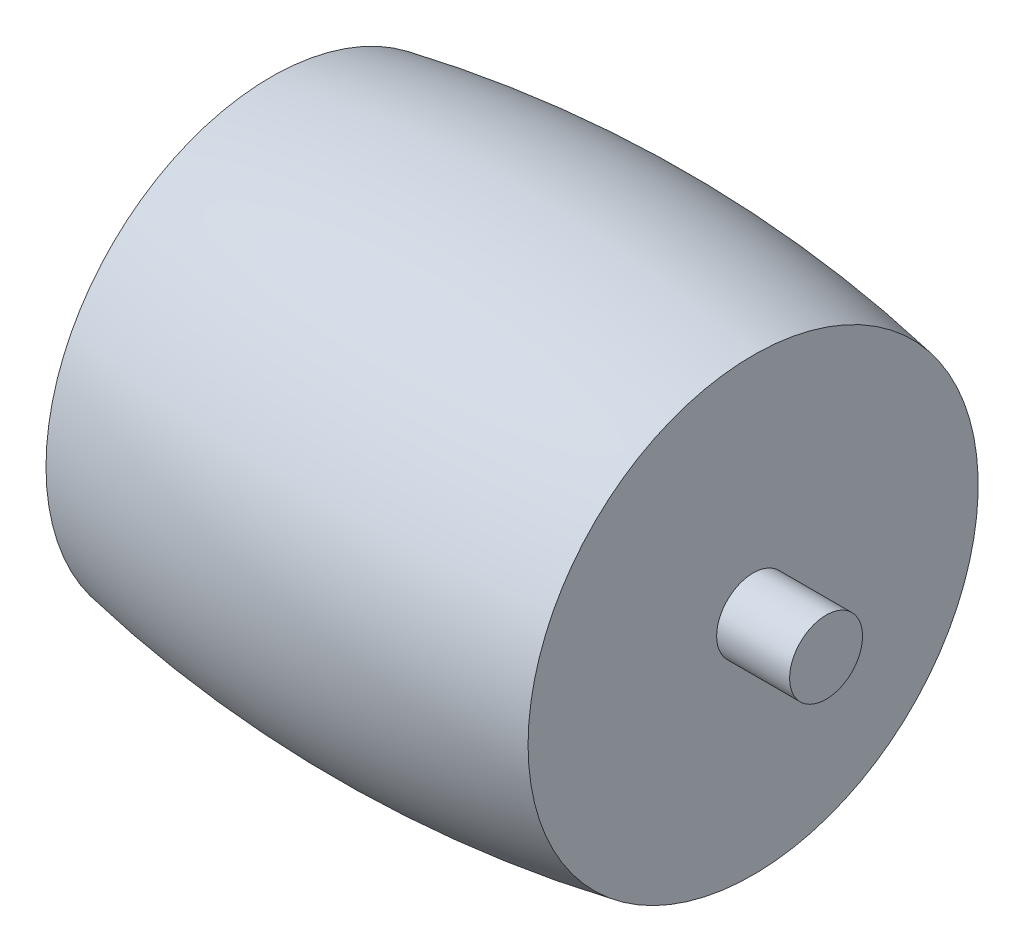
ISO-10303-21;
HEADER;
FILE_DESCRIPTION(('STEP AP214'),'2;1');
FILE_NAME('part.step','',(''),(''),'','','');
FILE_SCHEMA(('AUTOMOTIVE_DESIGN { 1 0 10303 214 1 1 1 1 }'));
ENDSEC;
DATA;
#1=APPLICATION_CONTEXT('core data for automotive mechanical design processes');
#2=APPLICATION_PROTOCOL_DEFINITION('international standard','automotive_design',2000,#1);
#3=PRODUCT_CONTEXT('',#1,'mechanical');
#4=PRODUCT('Part','Part','',(#3));
#5=PRODUCT_RELATED_PRODUCT_CATEGORY('part','',(#4));
#6=PRODUCT_DEFINITION_FORMATION('','',#4);
#7=PRODUCT_DEFINITION_CONTEXT('part definition',#1,'design');
#8=PRODUCT_DEFINITION('design','',#6,#7);
#9=PRODUCT_DEFINITION_SHAPE('','',#8);
#10=(LENGTH_UNIT() NAMED_UNIT(*) SI_UNIT(.MILLI.,.METRE.));
#11=(NAMED_UNIT(*) PLANE_ANGLE_UNIT() SI_UNIT($,.RADIAN.));
#12=(NAMED_UNIT(*) SI_UNIT($,.STERADIAN.) SOLID_ANGLE_UNIT());
#13=UNCERTAINTY_MEASURE_WITH_UNIT(LENGTH_MEASURE(1.E-05),#10,'distance_accuracy_value','');
#14=(GEOMETRIC_REPRESENTATION_CONTEXT(3) GLOBAL_UNCERTAINTY_ASSIGNED_CONTEXT((#13)) GLOBAL_UNIT_ASSIGNED_CONTEXT((#10,
#11,#12)) REPRESENTATION_CONTEXT('',''));
#15=CARTESIAN_POINT('',(0.,0.,0.));
#16=DIRECTION('',(0.,0.,1.));
#17=DIRECTION('',(1.,0.,0.));
#18=AXIS2_PLACEMENT_3D('',#15,#16,#17);
#19=CARTESIAN_POINT('',(-9.24999999999999,40.5,0.));
#20=DIRECTION('',(-1.,0.,0.));
#21=DIRECTION('',(0.,0.,1.));
#22=AXIS2_PLACEMENT_3D('',#19,#20,#21);
#23=CYLINDRICAL_SURFACE('',#22,1.39999999999998);
#24=CARTESIAN_POINT('',(9.24999999999999,40.5,0.));
#25=DIRECTION('',(-1.,0.,0.));
#26=DIRECTION('',(0.,0.,1.));
#27=AXIS2_PLACEMENT_3D('',#24,#25,#26);
#28=CIRCLE('',#27,1.39999999999998);
#29=CARTESIAN_POINT('',(9.24999999999999,40.5,1.39999999999998));
#30=VERTEX_POINT('',#29);
#31=EDGE_CURVE('E10',#30,#30,#28,.T.);
#32=ORIENTED_EDGE('',*,*,#31,.F.);
#33=EDGE_LOOP('',(#32));
#34=FACE_BOUND('',#33,.T.);
#35=CARTESIAN_POINT('',(12.05,40.5,0.));
#36=DIRECTION('',(-1.,0.,0.));
#37=DIRECTION('',(0.,0.,1.));
#38=AXIS2_PLACEMENT_3D('',#35,#36,#37);
#39=CIRCLE('',#38,1.39999999999998);
#40=CARTESIAN_POINT('',(12.05,40.5,1.39999999999998));
#41=VERTEX_POINT('',#40);
#42=EDGE_CURVE('E50',#41,#41,#39,.T.);
#43=ORIENTED_EDGE('',*,*,#42,.T.);
#44=EDGE_LOOP('',(#43));
#45=FACE_BOUND('',#44,.T.);
#46=ADVANCED_FACE('F28',(#34,#45),#23,.T.);
#47=CARTESIAN_POINT('',(9.25,49.1369260332797,0.));
#48=DIRECTION('',(-1.,0.,0.));
#49=DIRECTION('',(0.,0.,1.));
#50=AXIS2_PLACEMENT_3D('',#47,#48,#49);
#51=PLANE('',#50);
#52=CARTESIAN_POINT('',(9.25000000000001,40.5,0.));
#53=DIRECTION('',(-1.,0.,0.));
#54=DIRECTION('',(0.,0.,1.));
#55=AXIS2_PLACEMENT_3D('',#52,#53,#54);
#56=CIRCLE('',#55,8.63692603327968);
#57=CARTESIAN_POINT('',(9.25000000000001,40.5,8.63692603327968));
#58=VERTEX_POINT('',#57);
#59=EDGE_CURVE('E34',#58,#58,#56,.T.);
#60=ORIENTED_EDGE('',*,*,#59,.F.);
#61=EDGE_LOOP('',(#60));
#62=FACE_BOUND('',#61,.T.);
#63=ORIENTED_EDGE('',*,*,#31,.T.);
#64=EDGE_LOOP('',(#63));
#65=FACE_BOUND('',#64,.T.);
#66=ADVANCED_FACE('F66',(#62,#65),#51,.F.);
#67=CARTESIAN_POINT('',(0.,40.5,0.));
#68=DIRECTION('',(-1.,0.,0.));
#69=DIRECTION('',(0.,0.,1.));
#70=AXIS2_PLACEMENT_3D('',#67,#68,#69);
#71=DEGENERATE_TOROIDAL_SURFACE('',#70,40.5,50.,.F.);
#72=CARTESIAN_POINT('',(-9.25000000000001,40.5,0.));
#73=DIRECTION('',(-1.,0.,0.));
#74=DIRECTION('',(0.,0.,1.));
#75=AXIS2_PLACEMENT_3D('',#72,#73,#74);
#76=CIRCLE('',#75,8.63692603327969);
#77=CARTESIAN_POINT('',(-9.25000000000001,40.5,8.63692603327969));
#78=VERTEX_POINT('',#77);
#79=EDGE_CURVE('E38',#78,#78,#76,.T.);
#80=ORIENTED_EDGE('',*,*,#79,.F.);
#81=EDGE_LOOP('',(#80));
#82=FACE_BOUND('',#81,.T.);
#83=ORIENTED_EDGE('',*,*,#59,.T.);
#84=EDGE_LOOP('',(#83));
#85=FACE_BOUND('',#84,.T.);
#86=ADVANCED_FACE('F71',(#82,#85),#71,.F.);
#87=CARTESIAN_POINT('',(-9.25000000000001,49.1369260332797,0.));
#88=DIRECTION('',(1.,0.,0.));
#89=DIRECTION('',(0.,0.,-1.));
#90=AXIS2_PLACEMENT_3D('',#87,#88,#89);
#91=PLANE('',#90);
#92=CARTESIAN_POINT('',(-9.25,40.5,0.));
#93=DIRECTION('',(-1.,0.,0.));
#94=DIRECTION('',(0.,0.,1.));
#95=AXIS2_PLACEMENT_3D('',#92,#93,#94);
#96=CIRCLE('',#95,1.39999999999998);
#97=CARTESIAN_POINT('',(-9.25,40.5,1.39999999999998));
#98=VERTEX_POINT('',#97);
#99=EDGE_CURVE('E42',#98,#98,#96,.T.);
#100=ORIENTED_EDGE('',*,*,#99,.F.);
#101=EDGE_LOOP('',(#100));
#102=FACE_BOUND('',#101,.T.);
#103=ORIENTED_EDGE('',*,*,#79,.T.);
#104=EDGE_LOOP('',(#103));
#105=FACE_BOUND('',#104,.T.);
#106=ADVANCED_FACE('F76',(#102,#105),#91,.F.);
#107=CARTESIAN_POINT('',(-9.24999999999999,40.5,0.));
#108=DIRECTION('',(-1.,0.,0.));
#109=DIRECTION('',(0.,0.,1.));
#110=AXIS2_PLACEMENT_3D('',#107,#108,#109);
#111=CYLINDRICAL_SURFACE('',#110,1.39999999999998);
#112=CARTESIAN_POINT('',(-12.05,40.5,0.));
#113=DIRECTION('',(-1.,0.,0.));
#114=DIRECTION('',(0.,0.,1.));
#115=AXIS2_PLACEMENT_3D('',#112,#113,#114);
#116=CIRCLE('',#115,1.39999999999998);
#117=CARTESIAN_POINT('',(-12.05,40.5,1.39999999999998));
#118=VERTEX_POINT('',#117);
#119=EDGE_CURVE('E47',#118,#118,#116,.T.);
#120=ORIENTED_EDGE('',*,*,#119,.F.);
#121=EDGE_LOOP('',(#120));
#122=FACE_BOUND('',#121,.T.);
#123=ORIENTED_EDGE('',*,*,#99,.T.);
#124=EDGE_LOOP('',(#123));
#125=FACE_BOUND('',#124,.T.);
#126=ADVANCED_FACE('F62',(#122,#125),#111,.T.);
#127=CARTESIAN_POINT('',(-12.05,41.9,0.));
#128=DIRECTION('',(1.,0.,0.));
#129=DIRECTION('',(0.,0.,-1.));
#130=AXIS2_PLACEMENT_3D('',#127,#128,#129);
#131=PLANE('',#130);
#132=ORIENTED_EDGE('',*,*,#119,.T.);
#133=EDGE_LOOP('',(#132));
#134=FACE_BOUND('',#133,.T.);
#135=ADVANCED_FACE('F57',(#134),#131,.F.);
#136=CARTESIAN_POINT('',(12.05,41.9,0.));
#137=DIRECTION('',(-1.,0.,0.));
#138=DIRECTION('',(0.,0.,1.));
#139=AXIS2_PLACEMENT_3D('',#136,#137,#138);
#140=PLANE('',#139);
#141=ORIENTED_EDGE('',*,*,#42,.F.);
#142=EDGE_LOOP('',(#141));
#143=FACE_BOUND('',#142,.T.);
#144=ADVANCED_FACE('F55',(#143),#140,.F.);
#145=CLOSED_SHELL('',(#46,#66,#86,#106,#126,#135,#144));
#146=MANIFOLD_SOLID_BREP('B2',#145);
#147=ADVANCED_BREP_SHAPE_REPRESENTATION('',(#18,#146),#14);
#148=SHAPE_DEFINITION_REPRESENTATION(#9,#147);
ENDSEC;
END-ISO-10303-21;
